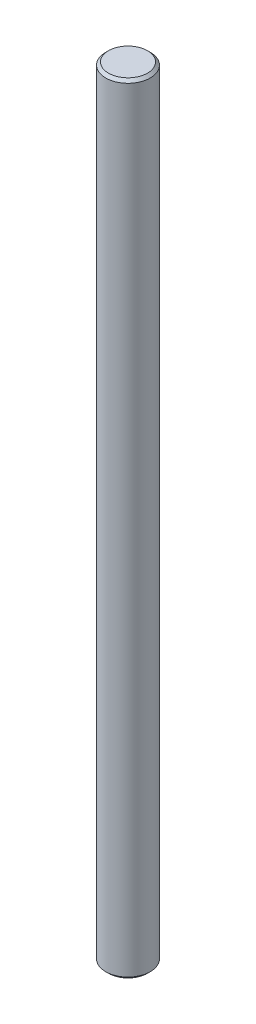
ISO-10303-21;
HEADER;
FILE_DESCRIPTION(('STEP AP214'),'2;1');
FILE_NAME('part.step','',(''),(''),'','','');
FILE_SCHEMA(('AUTOMOTIVE_DESIGN { 1 0 10303 214 1 1 1 1 }'));
ENDSEC;
DATA;
#1=APPLICATION_CONTEXT('core data for automotive mechanical design processes');
#2=APPLICATION_PROTOCOL_DEFINITION('international standard','automotive_design',2000,#1);
#3=PRODUCT_CONTEXT('',#1,'mechanical');
#4=PRODUCT('Part','Part','',(#3));
#5=PRODUCT_RELATED_PRODUCT_CATEGORY('part','',(#4));
#6=PRODUCT_DEFINITION_FORMATION('','',#4);
#7=PRODUCT_DEFINITION_CONTEXT('part definition',#1,'design');
#8=PRODUCT_DEFINITION('design','',#6,#7);
#9=PRODUCT_DEFINITION_SHAPE('','',#8);
#10=(LENGTH_UNIT() NAMED_UNIT(*) SI_UNIT(.MILLI.,.METRE.));
#11=(NAMED_UNIT(*) PLANE_ANGLE_UNIT() SI_UNIT($,.RADIAN.));
#12=(NAMED_UNIT(*) SI_UNIT($,.STERADIAN.) SOLID_ANGLE_UNIT());
#13=UNCERTAINTY_MEASURE_WITH_UNIT(LENGTH_MEASURE(1.E-05),#10,'distance_accuracy_value','');
#14=(GEOMETRIC_REPRESENTATION_CONTEXT(3) GLOBAL_UNCERTAINTY_ASSIGNED_CONTEXT((#13)) GLOBAL_UNIT_ASSIGNED_CONTEXT((#10,
#11,#12)) REPRESENTATION_CONTEXT('',''));
#15=CARTESIAN_POINT('',(0.,0.,0.));
#16=DIRECTION('',(0.,0.,1.));
#17=DIRECTION('',(1.,0.,0.));
#18=AXIS2_PLACEMENT_3D('',#15,#16,#17);
#19=CARTESIAN_POINT('',(0.,140.,0.));
#20=DIRECTION('',(0.,-1.,0.));
#21=DIRECTION('',(0.,0.,-1.));
#22=AXIS2_PLACEMENT_3D('',#19,#20,#21);
#23=CYLINDRICAL_SURFACE('',#22,4.);
#24=CARTESIAN_POINT('',(0.,0.500000000000028,0.));
#25=DIRECTION('',(0.,1.,0.));
#26=DIRECTION('',(0.,0.,1.));
#27=AXIS2_PLACEMENT_3D('',#24,#25,#26);
#28=CIRCLE('',#27,4.);
#29=CARTESIAN_POINT('',(0.,0.500000000000028,4.));
#30=VERTEX_POINT('',#29);
#31=EDGE_CURVE('E43',#30,#30,#28,.T.);
#32=ORIENTED_EDGE('',*,*,#31,.T.);
#33=EDGE_LOOP('',(#32));
#34=FACE_BOUND('',#33,.T.);
#35=CARTESIAN_POINT('',(0.,139.5,0.));
#36=DIRECTION('',(0.,1.,0.));
#37=DIRECTION('',(0.,0.,1.));
#38=AXIS2_PLACEMENT_3D('',#35,#36,#37);
#39=CIRCLE('',#38,4.);
#40=CARTESIAN_POINT('',(0.,139.5,4.));
#41=VERTEX_POINT('',#40);
#42=EDGE_CURVE('E47',#41,#41,#39,.F.);
#43=ORIENTED_EDGE('',*,*,#42,.T.);
#44=EDGE_LOOP('',(#43));
#45=FACE_BOUND('',#44,.T.);
#46=ADVANCED_FACE('F32',(#34,#45),#23,.T.);
#47=CARTESIAN_POINT('',(0.,140.,0.));
#48=DIRECTION('',(0.,1.,0.));
#49=DIRECTION('',(0.,0.,1.));
#50=AXIS2_PLACEMENT_3D('',#47,#48,#49);
#51=PLANE('',#50);
#52=CARTESIAN_POINT('',(0.,140.,0.));
#53=DIRECTION('',(0.,1.,0.));
#54=DIRECTION('',(0.,0.,1.));
#55=AXIS2_PLACEMENT_3D('',#52,#53,#54);
#56=CIRCLE('',#55,3.50000000000004);
#57=CARTESIAN_POINT('',(0.,140.,3.50000000000004));
#58=VERTEX_POINT('',#57);
#59=EDGE_CURVE('E10',#58,#58,#56,.T.);
#60=ORIENTED_EDGE('',*,*,#59,.T.);
#61=EDGE_LOOP('',(#60));
#62=FACE_BOUND('',#61,.T.);
#63=ADVANCED_FACE('F63',(#62),#51,.T.);
#64=CARTESIAN_POINT('',(0.,0.,0.));
#65=DIRECTION('',(0.,1.,0.));
#66=DIRECTION('',(0.,0.,1.));
#67=AXIS2_PLACEMENT_3D('',#64,#65,#66);
#68=PLANE('',#67);
#69=CARTESIAN_POINT('',(0.,0.,0.));
#70=DIRECTION('',(0.,1.,0.));
#71=DIRECTION('',(0.,0.,1.));
#72=AXIS2_PLACEMENT_3D('',#69,#70,#71);
#73=CIRCLE('',#72,3.49999999999998);
#74=CARTESIAN_POINT('',(0.,0.,3.49999999999998));
#75=VERTEX_POINT('',#74);
#76=EDGE_CURVE('E39',#75,#75,#73,.F.);
#77=ORIENTED_EDGE('',*,*,#76,.T.);
#78=EDGE_LOOP('',(#77));
#79=FACE_BOUND('',#78,.T.);
#80=ADVANCED_FACE('F60',(#79),#68,.F.);
#81=CARTESIAN_POINT('',(0.,0.500000000000028,0.));
#82=DIRECTION('',(0.,1.,0.));
#83=DIRECTION('',(0.,0.,1.));
#84=AXIS2_PLACEMENT_3D('',#81,#82,#83);
#85=CONICAL_SURFACE('',#84,4.,0.785398163397445);
#86=ORIENTED_EDGE('',*,*,#76,.F.);
#87=EDGE_LOOP('',(#86));
#88=FACE_BOUND('',#87,.T.);
#89=ORIENTED_EDGE('',*,*,#31,.F.);
#90=EDGE_LOOP('',(#89));
#91=FACE_BOUND('',#90,.T.);
#92=ADVANCED_FACE('F56',(#88,#91),#85,.T.);
#93=CARTESIAN_POINT('',(0.,140.,0.));
#94=DIRECTION('',(0.,-1.,0.));
#95=DIRECTION('',(0.,0.,-1.));
#96=AXIS2_PLACEMENT_3D('',#93,#94,#95);
#97=CONICAL_SURFACE('',#96,3.50000000000004,0.785398163397459);
#98=ORIENTED_EDGE('',*,*,#42,.F.);
#99=EDGE_LOOP('',(#98));
#100=FACE_BOUND('',#99,.T.);
#101=ORIENTED_EDGE('',*,*,#59,.F.);
#102=EDGE_LOOP('',(#101));
#103=FACE_BOUND('',#102,.T.);
#104=ADVANCED_FACE('F34',(#100,#103),#97,.T.);
#105=CLOSED_SHELL('',(#46,#63,#80,#92,#104));
#106=MANIFOLD_SOLID_BREP('B2',#105);
#107=ADVANCED_BREP_SHAPE_REPRESENTATION('',(#18,#106),#14);
#108=SHAPE_DEFINITION_REPRESENTATION(#9,#107);
ENDSEC;
END-ISO-10303-21;
